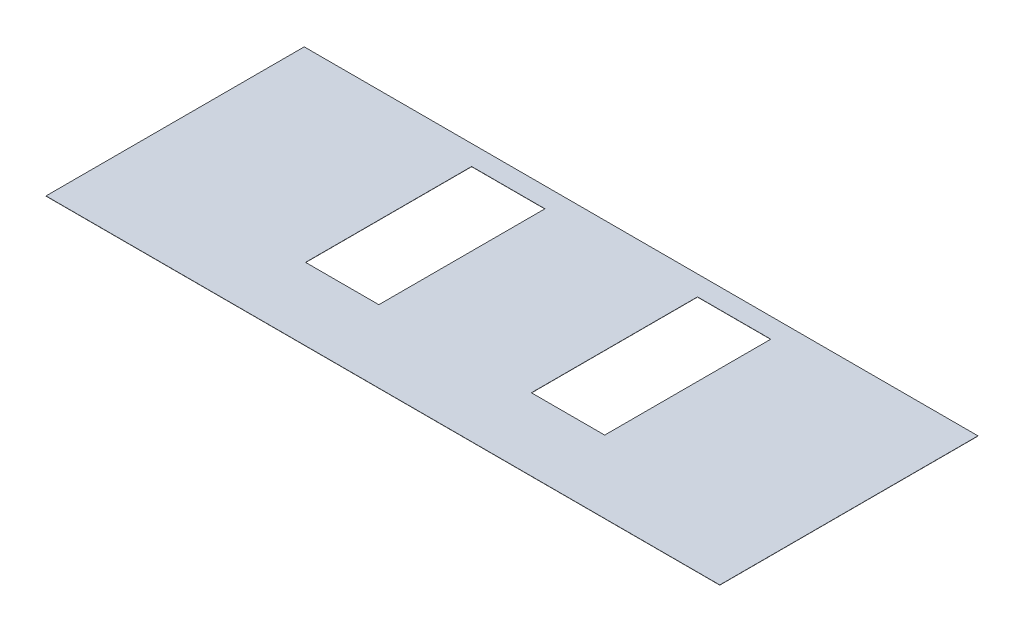
ISO-10303-21;
HEADER;
FILE_DESCRIPTION(('STEP AP214'),'2;1');
FILE_NAME('part.step','',(''),(''),'','','');
FILE_SCHEMA(('AUTOMOTIVE_DESIGN { 1 0 10303 214 1 1 1 1 }'));
ENDSEC;
DATA;
#1=APPLICATION_CONTEXT('core data for automotive mechanical design processes');
#2=APPLICATION_PROTOCOL_DEFINITION('international standard','automotive_design',2000,#1);
#3=PRODUCT_CONTEXT('',#1,'mechanical');
#4=PRODUCT('Part','Part','',(#3));
#5=PRODUCT_RELATED_PRODUCT_CATEGORY('part','',(#4));
#6=PRODUCT_DEFINITION_FORMATION('','',#4);
#7=PRODUCT_DEFINITION_CONTEXT('part definition',#1,'design');
#8=PRODUCT_DEFINITION('design','',#6,#7);
#9=PRODUCT_DEFINITION_SHAPE('','',#8);
#10=(LENGTH_UNIT() NAMED_UNIT(*) SI_UNIT(.MILLI.,.METRE.));
#11=(NAMED_UNIT(*) PLANE_ANGLE_UNIT() SI_UNIT($,.RADIAN.));
#12=(NAMED_UNIT(*) SI_UNIT($,.STERADIAN.) SOLID_ANGLE_UNIT());
#13=UNCERTAINTY_MEASURE_WITH_UNIT(LENGTH_MEASURE(1.E-05),#10,'distance_accuracy_value','');
#14=(GEOMETRIC_REPRESENTATION_CONTEXT(3) GLOBAL_UNCERTAINTY_ASSIGNED_CONTEXT((#13)) GLOBAL_UNIT_ASSIGNED_CONTEXT((#10,
#11,#12)) REPRESENTATION_CONTEXT('',''));
#15=CARTESIAN_POINT('',(0.,0.,0.));
#16=DIRECTION('',(0.,0.,1.));
#17=DIRECTION('',(1.,0.,0.));
#18=AXIS2_PLACEMENT_3D('',#15,#16,#17);
#19=CARTESIAN_POINT('',(2743.2,1.5875,1051.306));
#20=DIRECTION('',(-1.,0.,0.));
#21=DIRECTION('',(0.,0.,1.));
#22=AXIS2_PLACEMENT_3D('',#19,#20,#21);
#23=PLANE('',#22);
#24=DIRECTION('',(0.,0.,-1.));
#25=VECTOR('',#24,1.);
#26=CARTESIAN_POINT('',(2743.2,0.,1051.306));
#27=LINE('',#26,#25);
#28=CARTESIAN_POINT('',(2743.2,0.,1051.306));
#29=VERTEX_POINT('',#28);
#30=CARTESIAN_POINT('',(2743.2,0.,-1051.306));
#31=VERTEX_POINT('',#30);
#32=EDGE_CURVE('E203',#29,#31,#27,.T.);
#33=ORIENTED_EDGE('',*,*,#32,.T.);
#34=DIRECTION('',(0.,-1.,0.));
#35=VECTOR('',#34,1.);
#36=CARTESIAN_POINT('',(2743.2,1.5875,-1051.306));
#37=LINE('',#36,#35);
#38=CARTESIAN_POINT('',(2743.2,1.5875,-1051.306));
#39=VERTEX_POINT('',#38);
#40=EDGE_CURVE('E11',#39,#31,#37,.T.);
#41=ORIENTED_EDGE('',*,*,#40,.F.);
#42=DIRECTION('',(0.,0.,-1.));
#43=VECTOR('',#42,1.);
#44=CARTESIAN_POINT('',(2743.2,1.5875,1051.306));
#45=LINE('',#44,#43);
#46=CARTESIAN_POINT('',(2743.2,1.5875,1051.306));
#47=VERTEX_POINT('',#46);
#48=EDGE_CURVE('E204',#47,#39,#45,.T.);
#49=ORIENTED_EDGE('',*,*,#48,.F.);
#50=DIRECTION('',(0.,-1.,0.));
#51=VECTOR('',#50,1.);
#52=CARTESIAN_POINT('',(2743.2,1.5875,1051.306));
#53=LINE('',#52,#51);
#54=EDGE_CURVE('E214',#47,#29,#53,.T.);
#55=ORIENTED_EDGE('',*,*,#54,.T.);
#56=EDGE_LOOP('',(#33,#41,#49,#55));
#57=FACE_BOUND('',#56,.T.);
#58=ADVANCED_FACE('F40',(#57),#23,.F.);
#59=CARTESIAN_POINT('',(-2743.2,1.5875,-1051.306));
#60=DIRECTION('',(0.,0.,1.));
#61=DIRECTION('',(1.,0.,0.));
#62=AXIS2_PLACEMENT_3D('',#59,#60,#61);
#63=PLANE('',#62);
#64=DIRECTION('',(-1.,0.,0.));
#65=VECTOR('',#64,1.);
#66=CARTESIAN_POINT('',(-2743.2,0.,-1051.306));
#67=LINE('',#66,#65);
#68=CARTESIAN_POINT('',(-2743.2,0.,-1051.306));
#69=VERTEX_POINT('',#68);
#70=EDGE_CURVE('E217',#31,#69,#67,.T.);
#71=ORIENTED_EDGE('',*,*,#70,.T.);
#72=DIRECTION('',(0.,-1.,0.));
#73=VECTOR('',#72,1.);
#74=CARTESIAN_POINT('',(-2743.2,1.5875,-1051.306));
#75=LINE('',#74,#73);
#76=CARTESIAN_POINT('',(-2743.2,1.5875,-1051.306));
#77=VERTEX_POINT('',#76);
#78=EDGE_CURVE('E47',#77,#69,#75,.T.);
#79=ORIENTED_EDGE('',*,*,#78,.F.);
#80=DIRECTION('',(-1.,0.,0.));
#81=VECTOR('',#80,1.);
#82=CARTESIAN_POINT('',(-2743.2,1.5875,-1051.306));
#83=LINE('',#82,#81);
#84=EDGE_CURVE('E207',#39,#77,#83,.T.);
#85=ORIENTED_EDGE('',*,*,#84,.F.);
#86=ORIENTED_EDGE('',*,*,#40,.T.);
#87=EDGE_LOOP('',(#71,#79,#85,#86));
#88=FACE_BOUND('',#87,.T.);
#89=ADVANCED_FACE('F246',(#88),#63,.F.);
#90=CARTESIAN_POINT('',(-2743.2,1.5875,1051.306));
#91=DIRECTION('',(1.,0.,0.));
#92=DIRECTION('',(0.,0.,-1.));
#93=AXIS2_PLACEMENT_3D('',#90,#91,#92);
#94=PLANE('',#93);
#95=DIRECTION('',(0.,0.,1.));
#96=VECTOR('',#95,1.);
#97=CARTESIAN_POINT('',(-2743.2,0.,1051.306));
#98=LINE('',#97,#96);
#99=CARTESIAN_POINT('',(-2743.2,0.,1051.306));
#100=VERTEX_POINT('',#99);
#101=EDGE_CURVE('E219',#69,#100,#98,.T.);
#102=ORIENTED_EDGE('',*,*,#101,.T.);
#103=DIRECTION('',(0.,-1.,0.));
#104=VECTOR('',#103,1.);
#105=CARTESIAN_POINT('',(-2743.2,1.5875,1051.306));
#106=LINE('',#105,#104);
#107=CARTESIAN_POINT('',(-2743.2,1.5875,1051.306));
#108=VERTEX_POINT('',#107);
#109=EDGE_CURVE('E224',#108,#100,#106,.T.);
#110=ORIENTED_EDGE('',*,*,#109,.F.);
#111=DIRECTION('',(0.,0.,1.));
#112=VECTOR('',#111,1.);
#113=CARTESIAN_POINT('',(-2743.2,1.5875,1051.306));
#114=LINE('',#113,#112);
#115=EDGE_CURVE('E210',#77,#108,#114,.T.);
#116=ORIENTED_EDGE('',*,*,#115,.F.);
#117=ORIENTED_EDGE('',*,*,#78,.T.);
#118=EDGE_LOOP('',(#102,#110,#116,#117));
#119=FACE_BOUND('',#118,.T.);
#120=ADVANCED_FACE('F231',(#119),#94,.F.);
#121=CARTESIAN_POINT('',(-2743.2,1.5875,1051.306));
#122=DIRECTION('',(0.,0.,-1.));
#123=DIRECTION('',(-1.,0.,0.));
#124=AXIS2_PLACEMENT_3D('',#121,#122,#123);
#125=PLANE('',#124);
#126=DIRECTION('',(1.,0.,0.));
#127=VECTOR('',#126,1.);
#128=CARTESIAN_POINT('',(-2743.2,0.,1051.306));
#129=LINE('',#128,#127);
#130=EDGE_CURVE('E208',#100,#29,#129,.T.);
#131=ORIENTED_EDGE('',*,*,#130,.T.);
#132=ORIENTED_EDGE('',*,*,#54,.F.);
#133=DIRECTION('',(1.,0.,0.));
#134=VECTOR('',#133,1.);
#135=CARTESIAN_POINT('',(-2743.2,1.5875,1051.306));
#136=LINE('',#135,#134);
#137=EDGE_CURVE('E212',#108,#47,#136,.T.);
#138=ORIENTED_EDGE('',*,*,#137,.F.);
#139=ORIENTED_EDGE('',*,*,#109,.T.);
#140=EDGE_LOOP('',(#131,#132,#138,#139));
#141=FACE_BOUND('',#140,.T.);
#142=ADVANCED_FACE('F239',(#141),#125,.F.);
#143=CARTESIAN_POINT('',(0.,1.5875,0.));
#144=DIRECTION('',(0.,-1.,0.));
#145=DIRECTION('',(0.,0.,-1.));
#146=AXIS2_PLACEMENT_3D('',#143,#144,#145);
#147=PLANE('',#146);
#148=DIRECTION('',(1.,0.,0.));
#149=VECTOR('',#148,1.);
#150=CARTESIAN_POINT('',(1.65423230669148E-13,1.5875,-889.381));
#151=LINE('',#150,#149);
#152=CARTESIAN_POINT('',(-1217.93,1.5875,-889.381));
#153=VERTEX_POINT('',#152);
#154=CARTESIAN_POINT('',(-621.03,1.5875,-889.381));
#155=VERTEX_POINT('',#154);
#156=EDGE_CURVE('E194',#153,#155,#151,.T.);
#157=ORIENTED_EDGE('',*,*,#156,.T.);
#158=DIRECTION('',(0.,0.,1.));
#159=VECTOR('',#158,1.);
#160=CARTESIAN_POINT('',(-621.03,1.5875,1.01952874937409E-13));
#161=LINE('',#160,#159);
#162=CARTESIAN_POINT('',(-621.03,1.5875,463.169));
#163=VERTEX_POINT('',#162);
#164=EDGE_CURVE('E133',#155,#163,#161,.T.);
#165=ORIENTED_EDGE('',*,*,#164,.T.);
#166=DIRECTION('',(-1.,0.,0.));
#167=VECTOR('',#166,1.);
#168=CARTESIAN_POINT('',(0.,1.5875,463.169));
#169=LINE('',#168,#167);
#170=CARTESIAN_POINT('',(-1217.93,1.5875,463.169));
#171=VERTEX_POINT('',#170);
#172=EDGE_CURVE('E199',#163,#171,#169,.T.);
#173=ORIENTED_EDGE('',*,*,#172,.T.);
#174=DIRECTION('',(0.,0.,-1.));
#175=VECTOR('',#174,1.);
#176=CARTESIAN_POINT('',(-1217.93,1.5875,1.9994439072592E-13));
#177=LINE('',#176,#175);
#178=EDGE_CURVE('E196',#171,#153,#177,.T.);
#179=ORIENTED_EDGE('',*,*,#178,.T.);
#180=EDGE_LOOP('',(#157,#165,#173,#179));
#181=FACE_BOUND('',#180,.T.);
#182=DIRECTION('',(1.,0.,0.));
#183=VECTOR('',#182,1.);
#184=CARTESIAN_POINT('',(3.30846461338297E-13,1.5875,-889.381000000001));
#185=LINE('',#184,#183);
#186=CARTESIAN_POINT('',(621.03,1.5875,-889.381));
#187=VERTEX_POINT('',#186);
#188=CARTESIAN_POINT('',(1217.93,1.5875,-889.381));
#189=VERTEX_POINT('',#188);
#190=EDGE_CURVE('E160',#187,#189,#185,.T.);
#191=ORIENTED_EDGE('',*,*,#190,.T.);
#192=DIRECTION('',(0.,0.,1.));
#193=VECTOR('',#192,1.);
#194=CARTESIAN_POINT('',(1217.93,1.5875,0.));
#195=LINE('',#194,#193);
#196=CARTESIAN_POINT('',(1217.93,1.5875,463.169));
#197=VERTEX_POINT('',#196);
#198=EDGE_CURVE('E191',#189,#197,#195,.T.);
#199=ORIENTED_EDGE('',*,*,#198,.T.);
#200=DIRECTION('',(-1.,0.,0.));
#201=VECTOR('',#200,1.);
#202=CARTESIAN_POINT('',(-1.72297164715232E-13,1.5875,463.168999999999));
#203=LINE('',#202,#201);
#204=CARTESIAN_POINT('',(621.03,1.5875,463.169));
#205=VERTEX_POINT('',#204);
#206=EDGE_CURVE('E188',#197,#205,#203,.T.);
#207=ORIENTED_EDGE('',*,*,#206,.T.);
#208=DIRECTION('',(0.,0.,-1.));
#209=VECTOR('',#208,1.);
#210=CARTESIAN_POINT('',(621.03,1.5875,-1.52929312406113E-13));
#211=LINE('',#210,#209);
#212=EDGE_CURVE('E185',#205,#187,#211,.T.);
#213=ORIENTED_EDGE('',*,*,#212,.T.);
#214=EDGE_LOOP('',(#191,#199,#207,#213));
#215=FACE_BOUND('',#214,.T.);
#216=ORIENTED_EDGE('',*,*,#48,.T.);
#217=ORIENTED_EDGE('',*,*,#84,.T.);
#218=ORIENTED_EDGE('',*,*,#115,.T.);
#219=ORIENTED_EDGE('',*,*,#137,.T.);
#220=EDGE_LOOP('',(#216,#217,#218,#219));
#221=FACE_BOUND('',#220,.T.);
#222=ADVANCED_FACE('F245',(#181,#215,#221),#147,.F.);
#223=CARTESIAN_POINT('',(0.,0.,0.));
#224=DIRECTION('',(0.,-1.,0.));
#225=DIRECTION('',(0.,0.,-1.));
#226=AXIS2_PLACEMENT_3D('',#223,#224,#225);
#227=PLANE('',#226);
#228=DIRECTION('',(0.,0.,-1.));
#229=VECTOR('',#228,1.);
#230=CARTESIAN_POINT('',(-621.03,0.,-889.381));
#231=LINE('',#230,#229);
#232=CARTESIAN_POINT('',(-621.03,0.,463.169));
#233=VERTEX_POINT('',#232);
#234=CARTESIAN_POINT('',(-621.03,0.,-889.381));
#235=VERTEX_POINT('',#234);
#236=EDGE_CURVE('E130',#233,#235,#231,.T.);
#237=ORIENTED_EDGE('',*,*,#236,.T.);
#238=DIRECTION('',(-1.,0.,0.));
#239=VECTOR('',#238,1.);
#240=CARTESIAN_POINT('',(-1217.93,0.,-889.381));
#241=LINE('',#240,#239);
#242=CARTESIAN_POINT('',(-1217.93,0.,-889.381));
#243=VERTEX_POINT('',#242);
#244=EDGE_CURVE('E140',#235,#243,#241,.T.);
#245=ORIENTED_EDGE('',*,*,#244,.T.);
#246=DIRECTION('',(0.,0.,1.));
#247=VECTOR('',#246,1.);
#248=CARTESIAN_POINT('',(-1217.93,0.,-889.381));
#249=LINE('',#248,#247);
#250=CARTESIAN_POINT('',(-1217.93,0.,463.169));
#251=VERTEX_POINT('',#250);
#252=EDGE_CURVE('E145',#243,#251,#249,.T.);
#253=ORIENTED_EDGE('',*,*,#252,.T.);
#254=DIRECTION('',(1.,0.,0.));
#255=VECTOR('',#254,1.);
#256=CARTESIAN_POINT('',(-1217.93,0.,463.169));
#257=LINE('',#256,#255);
#258=EDGE_CURVE('E136',#251,#233,#257,.T.);
#259=ORIENTED_EDGE('',*,*,#258,.T.);
#260=EDGE_LOOP('',(#237,#245,#253,#259));
#261=FACE_BOUND('',#260,.T.);
#262=DIRECTION('',(0.,0.,-1.));
#263=VECTOR('',#262,1.);
#264=CARTESIAN_POINT('',(1217.93,0.,-889.381));
#265=LINE('',#264,#263);
#266=CARTESIAN_POINT('',(1217.93,0.,463.169));
#267=VERTEX_POINT('',#266);
#268=CARTESIAN_POINT('',(1217.93,0.,-889.381));
#269=VERTEX_POINT('',#268);
#270=EDGE_CURVE('E150',#267,#269,#265,.T.);
#271=ORIENTED_EDGE('',*,*,#270,.T.);
#272=DIRECTION('',(-1.,0.,0.));
#273=VECTOR('',#272,1.);
#274=CARTESIAN_POINT('',(621.03,0.,-889.381));
#275=LINE('',#274,#273);
#276=CARTESIAN_POINT('',(621.03,0.,-889.381));
#277=VERTEX_POINT('',#276);
#278=EDGE_CURVE('E153',#269,#277,#275,.T.);
#279=ORIENTED_EDGE('',*,*,#278,.T.);
#280=DIRECTION('',(0.,0.,1.));
#281=VECTOR('',#280,1.);
#282=CARTESIAN_POINT('',(621.03,0.,-889.381));
#283=LINE('',#282,#281);
#284=CARTESIAN_POINT('',(621.03,0.,463.169));
#285=VERTEX_POINT('',#284);
#286=EDGE_CURVE('E178',#277,#285,#283,.T.);
#287=ORIENTED_EDGE('',*,*,#286,.T.);
#288=DIRECTION('',(1.,0.,0.));
#289=VECTOR('',#288,1.);
#290=CARTESIAN_POINT('',(621.03,0.,463.169));
#291=LINE('',#290,#289);
#292=EDGE_CURVE('E166',#285,#267,#291,.T.);
#293=ORIENTED_EDGE('',*,*,#292,.T.);
#294=EDGE_LOOP('',(#271,#279,#287,#293));
#295=FACE_BOUND('',#294,.T.);
#296=ORIENTED_EDGE('',*,*,#32,.F.);
#297=ORIENTED_EDGE('',*,*,#130,.F.);
#298=ORIENTED_EDGE('',*,*,#101,.F.);
#299=ORIENTED_EDGE('',*,*,#70,.F.);
#300=EDGE_LOOP('',(#296,#297,#298,#299));
#301=FACE_BOUND('',#300,.T.);
#302=ADVANCED_FACE('F147',(#261,#295,#301),#227,.T.);
#303=CARTESIAN_POINT('',(1217.93,0.,-889.381));
#304=DIRECTION('',(1.,0.,0.));
#305=DIRECTION('',(0.,0.,-1.));
#306=AXIS2_PLACEMENT_3D('',#303,#304,#305);
#307=PLANE('',#306);
#308=DIRECTION('',(0.,1.,0.));
#309=VECTOR('',#308,1.);
#310=CARTESIAN_POINT('',(1217.93,0.,-889.381));
#311=LINE('',#310,#309);
#312=EDGE_CURVE('E62',#269,#189,#311,.T.);
#313=ORIENTED_EDGE('',*,*,#312,.F.);
#314=ORIENTED_EDGE('',*,*,#270,.F.);
#315=DIRECTION('',(0.,1.,0.));
#316=VECTOR('',#315,1.);
#317=CARTESIAN_POINT('',(1217.93,0.,463.169));
#318=LINE('',#317,#316);
#319=EDGE_CURVE('E173',#267,#197,#318,.T.);
#320=ORIENTED_EDGE('',*,*,#319,.T.);
#321=ORIENTED_EDGE('',*,*,#198,.F.);
#322=EDGE_LOOP('',(#313,#314,#320,#321));
#323=FACE_BOUND('',#322,.T.);
#324=ADVANCED_FACE('F258',(#323),#307,.F.);
#325=CARTESIAN_POINT('',(621.03,0.,463.169));
#326=DIRECTION('',(0.,0.,1.));
#327=DIRECTION('',(1.,0.,0.));
#328=AXIS2_PLACEMENT_3D('',#325,#326,#327);
#329=PLANE('',#328);
#330=ORIENTED_EDGE('',*,*,#319,.F.);
#331=ORIENTED_EDGE('',*,*,#292,.F.);
#332=DIRECTION('',(0.,1.,0.));
#333=VECTOR('',#332,1.);
#334=CARTESIAN_POINT('',(621.03,0.,463.169));
#335=LINE('',#334,#333);
#336=EDGE_CURVE('E170',#285,#205,#335,.T.);
#337=ORIENTED_EDGE('',*,*,#336,.T.);
#338=ORIENTED_EDGE('',*,*,#206,.F.);
#339=EDGE_LOOP('',(#330,#331,#337,#338));
#340=FACE_BOUND('',#339,.T.);
#341=ADVANCED_FACE('F262',(#340),#329,.F.);
#342=CARTESIAN_POINT('',(621.03,0.,-889.381));
#343=DIRECTION('',(-1.,0.,0.));
#344=DIRECTION('',(0.,0.,1.));
#345=AXIS2_PLACEMENT_3D('',#342,#343,#344);
#346=PLANE('',#345);
#347=ORIENTED_EDGE('',*,*,#336,.F.);
#348=ORIENTED_EDGE('',*,*,#286,.F.);
#349=DIRECTION('',(0.,1.,0.));
#350=VECTOR('',#349,1.);
#351=CARTESIAN_POINT('',(621.03,0.,-889.381));
#352=LINE('',#351,#350);
#353=EDGE_CURVE('E167',#277,#187,#352,.T.);
#354=ORIENTED_EDGE('',*,*,#353,.T.);
#355=ORIENTED_EDGE('',*,*,#212,.F.);
#356=EDGE_LOOP('',(#347,#348,#354,#355));
#357=FACE_BOUND('',#356,.T.);
#358=ADVANCED_FACE('F265',(#357),#346,.F.);
#359=CARTESIAN_POINT('',(621.03,0.,-889.381));
#360=DIRECTION('',(0.,0.,-1.));
#361=DIRECTION('',(-1.,0.,0.));
#362=AXIS2_PLACEMENT_3D('',#359,#360,#361);
#363=PLANE('',#362);
#364=ORIENTED_EDGE('',*,*,#353,.F.);
#365=ORIENTED_EDGE('',*,*,#278,.F.);
#366=ORIENTED_EDGE('',*,*,#312,.T.);
#367=ORIENTED_EDGE('',*,*,#190,.F.);
#368=EDGE_LOOP('',(#364,#365,#366,#367));
#369=FACE_BOUND('',#368,.T.);
#370=ADVANCED_FACE('F269',(#369),#363,.F.);
#371=CARTESIAN_POINT('',(-621.03,0.,-889.381));
#372=DIRECTION('',(1.,0.,0.));
#373=DIRECTION('',(0.,0.,-1.));
#374=AXIS2_PLACEMENT_3D('',#371,#372,#373);
#375=PLANE('',#374);
#376=DIRECTION('',(0.,1.,0.));
#377=VECTOR('',#376,1.);
#378=CARTESIAN_POINT('',(-621.03,0.,-889.381));
#379=LINE('',#378,#377);
#380=EDGE_CURVE('E54',#235,#155,#379,.T.);
#381=ORIENTED_EDGE('',*,*,#380,.F.);
#382=ORIENTED_EDGE('',*,*,#236,.F.);
#383=DIRECTION('',(0.,1.,0.));
#384=VECTOR('',#383,1.);
#385=CARTESIAN_POINT('',(-621.03,0.,463.169));
#386=LINE('',#385,#384);
#387=EDGE_CURVE('E158',#233,#163,#386,.T.);
#388=ORIENTED_EDGE('',*,*,#387,.T.);
#389=ORIENTED_EDGE('',*,*,#164,.F.);
#390=EDGE_LOOP('',(#381,#382,#388,#389));
#391=FACE_BOUND('',#390,.T.);
#392=ADVANCED_FACE('F127',(#391),#375,.F.);
#393=CARTESIAN_POINT('',(-1217.93,0.,463.169));
#394=DIRECTION('',(0.,0.,1.));
#395=DIRECTION('',(1.,0.,0.));
#396=AXIS2_PLACEMENT_3D('',#393,#394,#395);
#397=PLANE('',#396);
#398=ORIENTED_EDGE('',*,*,#387,.F.);
#399=ORIENTED_EDGE('',*,*,#258,.F.);
#400=DIRECTION('',(0.,1.,0.));
#401=VECTOR('',#400,1.);
#402=CARTESIAN_POINT('',(-1217.93,0.,463.169));
#403=LINE('',#402,#401);
#404=EDGE_CURVE('E161',#251,#171,#403,.T.);
#405=ORIENTED_EDGE('',*,*,#404,.T.);
#406=ORIENTED_EDGE('',*,*,#172,.F.);
#407=EDGE_LOOP('',(#398,#399,#405,#406));
#408=FACE_BOUND('',#407,.T.);
#409=ADVANCED_FACE('F278',(#408),#397,.F.);
#410=CARTESIAN_POINT('',(-1217.93,0.,-889.381));
#411=DIRECTION('',(-1.,0.,0.));
#412=DIRECTION('',(0.,0.,1.));
#413=AXIS2_PLACEMENT_3D('',#410,#411,#412);
#414=PLANE('',#413);
#415=ORIENTED_EDGE('',*,*,#404,.F.);
#416=ORIENTED_EDGE('',*,*,#252,.F.);
#417=DIRECTION('',(0.,1.,0.));
#418=VECTOR('',#417,1.);
#419=CARTESIAN_POINT('',(-1217.93,0.,-889.381));
#420=LINE('',#419,#418);
#421=EDGE_CURVE('E135',#243,#153,#420,.T.);
#422=ORIENTED_EDGE('',*,*,#421,.T.);
#423=ORIENTED_EDGE('',*,*,#178,.F.);
#424=EDGE_LOOP('',(#415,#416,#422,#423));
#425=FACE_BOUND('',#424,.T.);
#426=ADVANCED_FACE('F281',(#425),#414,.F.);
#427=CARTESIAN_POINT('',(-1217.93,0.,-889.381));
#428=DIRECTION('',(0.,0.,-1.));
#429=DIRECTION('',(-1.,0.,0.));
#430=AXIS2_PLACEMENT_3D('',#427,#428,#429);
#431=PLANE('',#430);
#432=ORIENTED_EDGE('',*,*,#421,.F.);
#433=ORIENTED_EDGE('',*,*,#244,.F.);
#434=ORIENTED_EDGE('',*,*,#380,.T.);
#435=ORIENTED_EDGE('',*,*,#156,.F.);
#436=EDGE_LOOP('',(#432,#433,#434,#435));
#437=FACE_BOUND('',#436,.T.);
#438=ADVANCED_FACE('F141',(#437),#431,.F.);
#439=CLOSED_SHELL('',(#58,#89,#120,#142,#222,#302,#324,#341,#358,#370,#392,#409,#426,#438));
#440=MANIFOLD_SOLID_BREP('B2',#439);
#441=ADVANCED_BREP_SHAPE_REPRESENTATION('',(#18,#440),#14);
#442=SHAPE_DEFINITION_REPRESENTATION(#9,#441);
ENDSEC;
END-ISO-10303-21;
